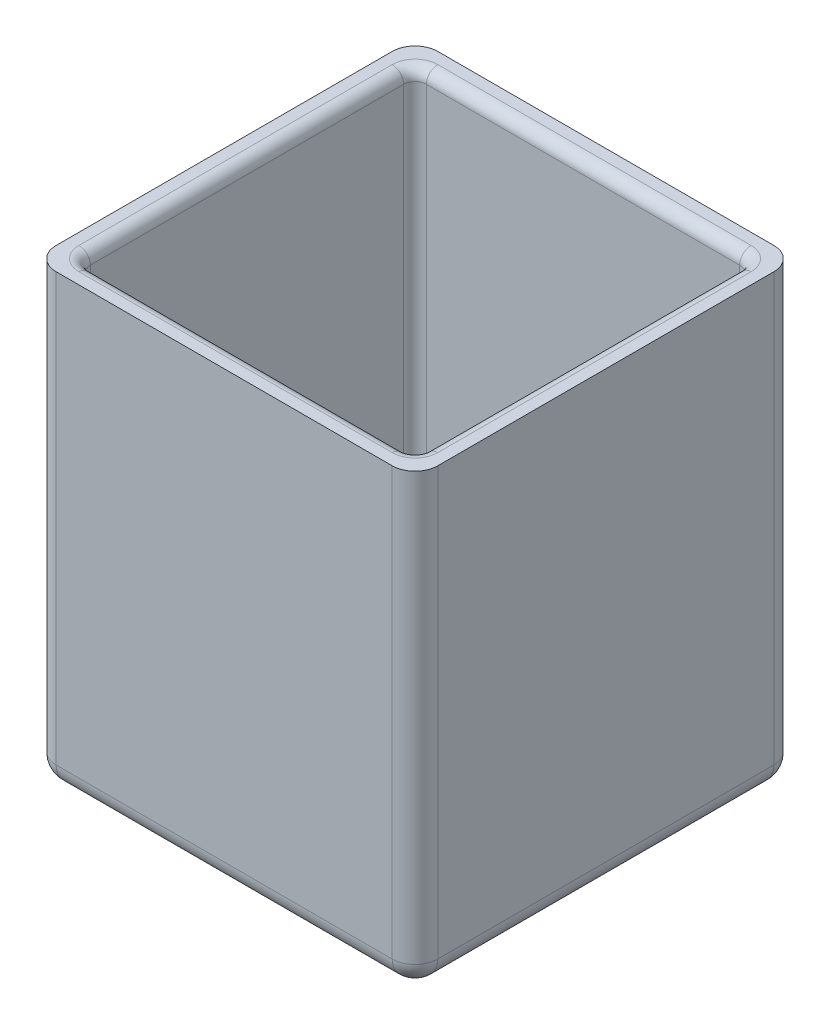
ISO-10303-21;
HEADER;
FILE_DESCRIPTION(('STEP AP214'),'2;1');
FILE_NAME('part.step','',(''),(''),'','','');
FILE_SCHEMA(('AUTOMOTIVE_DESIGN { 1 0 10303 214 1 1 1 1 }'));
ENDSEC;
DATA;
#1=APPLICATION_CONTEXT('core data for automotive mechanical design processes');
#2=APPLICATION_PROTOCOL_DEFINITION('international standard','automotive_design',2000,#1);
#3=PRODUCT_CONTEXT('',#1,'mechanical');
#4=PRODUCT('Part','Part','',(#3));
#5=PRODUCT_RELATED_PRODUCT_CATEGORY('part','',(#4));
#6=PRODUCT_DEFINITION_FORMATION('','',#4);
#7=PRODUCT_DEFINITION_CONTEXT('part definition',#1,'design');
#8=PRODUCT_DEFINITION('design','',#6,#7);
#9=PRODUCT_DEFINITION_SHAPE('','',#8);
#10=(LENGTH_UNIT() NAMED_UNIT(*) SI_UNIT(.MILLI.,.METRE.));
#11=(NAMED_UNIT(*) PLANE_ANGLE_UNIT() SI_UNIT($,.RADIAN.));
#12=(NAMED_UNIT(*) SI_UNIT($,.STERADIAN.) SOLID_ANGLE_UNIT());
#13=UNCERTAINTY_MEASURE_WITH_UNIT(LENGTH_MEASURE(1.E-05),#10,'distance_accuracy_value','');
#14=(GEOMETRIC_REPRESENTATION_CONTEXT(3) GLOBAL_UNCERTAINTY_ASSIGNED_CONTEXT((#13)) GLOBAL_UNIT_ASSIGNED_CONTEXT((#10,
#11,#12)) REPRESENTATION_CONTEXT('',''));
#15=CARTESIAN_POINT('',(0.,0.,0.));
#16=DIRECTION('',(0.,0.,1.));
#17=DIRECTION('',(1.,0.,0.));
#18=AXIS2_PLACEMENT_3D('',#15,#16,#17);
#19=CARTESIAN_POINT('',(0.,39.5,0.));
#20=DIRECTION('',(0.,-1.,0.));
#21=DIRECTION('',(0.,0.,-1.));
#22=AXIS2_PLACEMENT_3D('',#19,#20,#21);
#23=PLANE('',#22);
#24=DIRECTION('',(-1.,0.,0.));
#25=VECTOR('',#24,1.);
#26=CARTESIAN_POINT('',(0.,39.5,-33.5));
#27=LINE('',#26,#25);
#28=CARTESIAN_POINT('',(31.5,39.5,-33.5));
#29=VERTEX_POINT('',#28);
#30=CARTESIAN_POINT('',(2.,39.5,-33.5));
#31=VERTEX_POINT('',#30);
#32=EDGE_CURVE('E207',#29,#31,#27,.T.);
#33=ORIENTED_EDGE('',*,*,#32,.T.);
#34=CARTESIAN_POINT('',(2.,39.5,-31.5));
#35=DIRECTION('',(0.,-1.,0.));
#36=DIRECTION('',(0.,0.,-1.));
#37=AXIS2_PLACEMENT_3D('',#34,#35,#36);
#38=CIRCLE('',#37,2.);
#39=CARTESIAN_POINT('',(0.,39.5,-31.5));
#40=VERTEX_POINT('',#39);
#41=EDGE_CURVE('E201',#31,#40,#38,.F.);
#42=ORIENTED_EDGE('',*,*,#41,.T.);
#43=DIRECTION('',(0.,0.,1.));
#44=VECTOR('',#43,1.);
#45=CARTESIAN_POINT('',(0.,39.5,0.));
#46=LINE('',#45,#44);
#47=CARTESIAN_POINT('',(0.,39.5,-2.));
#48=VERTEX_POINT('',#47);
#49=EDGE_CURVE('E204',#40,#48,#46,.T.);
#50=ORIENTED_EDGE('',*,*,#49,.T.);
#51=CARTESIAN_POINT('',(2.,39.5,-2.));
#52=DIRECTION('',(0.,-1.,0.));
#53=DIRECTION('',(0.,0.,-1.));
#54=AXIS2_PLACEMENT_3D('',#51,#52,#53);
#55=CIRCLE('',#54,2.);
#56=CARTESIAN_POINT('',(2.,39.5,0.));
#57=VERTEX_POINT('',#56);
#58=EDGE_CURVE('E212',#48,#57,#55,.F.);
#59=ORIENTED_EDGE('',*,*,#58,.T.);
#60=DIRECTION('',(1.,0.,0.));
#61=VECTOR('',#60,1.);
#62=CARTESIAN_POINT('',(0.,39.5,0.));
#63=LINE('',#62,#61);
#64=CARTESIAN_POINT('',(31.5,39.5,0.));
#65=VERTEX_POINT('',#64);
#66=EDGE_CURVE('E221',#57,#65,#63,.T.);
#67=ORIENTED_EDGE('',*,*,#66,.T.);
#68=CARTESIAN_POINT('',(31.5,39.5,-2.));
#69=DIRECTION('',(0.,-1.,0.));
#70=DIRECTION('',(0.,0.,-1.));
#71=AXIS2_PLACEMENT_3D('',#68,#69,#70);
#72=CIRCLE('',#71,2.);
#73=CARTESIAN_POINT('',(33.5,39.5,-2.));
#74=VERTEX_POINT('',#73);
#75=EDGE_CURVE('E236',#65,#74,#72,.F.);
#76=ORIENTED_EDGE('',*,*,#75,.T.);
#77=DIRECTION('',(0.,0.,-1.));
#78=VECTOR('',#77,1.);
#79=CARTESIAN_POINT('',(33.5,39.5,0.));
#80=LINE('',#79,#78);
#81=CARTESIAN_POINT('',(33.5,39.5,-31.5));
#82=VERTEX_POINT('',#81);
#83=EDGE_CURVE('E912',#74,#82,#80,.T.);
#84=ORIENTED_EDGE('',*,*,#83,.T.);
#85=CARTESIAN_POINT('',(31.5,39.5,-31.5));
#86=DIRECTION('',(0.,-1.,0.));
#87=DIRECTION('',(0.,0.,-1.));
#88=AXIS2_PLACEMENT_3D('',#85,#86,#87);
#89=CIRCLE('',#88,2.);
#90=EDGE_CURVE('E238',#82,#29,#89,.F.);
#91=ORIENTED_EDGE('',*,*,#90,.T.);
#92=EDGE_LOOP('',(#33,#42,#50,#59,#67,#76,#84,#91));
#93=FACE_BOUND('',#92,.T.);
#94=CARTESIAN_POINT('',(30.5,39.5,-3.00000000000002));
#95=DIRECTION('',(0.,-1.,0.));
#96=DIRECTION('',(0.,0.,-1.));
#97=AXIS2_PLACEMENT_3D('',#94,#95,#96);
#98=CIRCLE('',#97,2.);
#99=CARTESIAN_POINT('',(30.5,39.5,-1.00000000000002));
#100=VERTEX_POINT('',#99);
#101=CARTESIAN_POINT('',(32.5,39.5,-3.00000000000002));
#102=VERTEX_POINT('',#101);
#103=EDGE_CURVE('E323',#100,#102,#98,.F.);
#104=ORIENTED_EDGE('',*,*,#103,.F.);
#105=DIRECTION('',(1.,0.,0.));
#106=VECTOR('',#105,1.);
#107=CARTESIAN_POINT('',(2.,39.5,-1.));
#108=LINE('',#107,#106);
#109=CARTESIAN_POINT('',(3.,39.5,-1.));
#110=VERTEX_POINT('',#109);
#111=EDGE_CURVE('E320',#100,#110,#108,.F.);
#112=ORIENTED_EDGE('',*,*,#111,.T.);
#113=CARTESIAN_POINT('',(3.,39.5,-3.));
#114=DIRECTION('',(0.,-1.,0.));
#115=DIRECTION('',(0.,0.,-1.));
#116=AXIS2_PLACEMENT_3D('',#113,#114,#115);
#117=CIRCLE('',#116,2.);
#118=CARTESIAN_POINT('',(1.,39.5,-3.));
#119=VERTEX_POINT('',#118);
#120=EDGE_CURVE('E317',#119,#110,#117,.F.);
#121=ORIENTED_EDGE('',*,*,#120,.F.);
#122=DIRECTION('',(0.,0.,1.));
#123=VECTOR('',#122,1.);
#124=CARTESIAN_POINT('',(1.,39.5,-31.5));
#125=LINE('',#124,#123);
#126=CARTESIAN_POINT('',(1.,39.5,-30.5));
#127=VERTEX_POINT('',#126);
#128=EDGE_CURVE('E313',#119,#127,#125,.F.);
#129=ORIENTED_EDGE('',*,*,#128,.T.);
#130=CARTESIAN_POINT('',(3.,39.5,-30.5));
#131=DIRECTION('',(0.,-1.,0.));
#132=DIRECTION('',(0.,0.,-1.));
#133=AXIS2_PLACEMENT_3D('',#130,#131,#132);
#134=CIRCLE('',#133,2.);
#135=CARTESIAN_POINT('',(3.,39.5,-32.5));
#136=VERTEX_POINT('',#135);
#137=EDGE_CURVE('E310',#136,#127,#134,.F.);
#138=ORIENTED_EDGE('',*,*,#137,.F.);
#139=DIRECTION('',(-1.,0.,0.));
#140=VECTOR('',#139,1.);
#141=CARTESIAN_POINT('',(31.5,39.5,-32.5));
#142=LINE('',#141,#140);
#143=CARTESIAN_POINT('',(30.5,39.5,-32.5));
#144=VERTEX_POINT('',#143);
#145=EDGE_CURVE('E308',#136,#144,#142,.F.);
#146=ORIENTED_EDGE('',*,*,#145,.T.);
#147=CARTESIAN_POINT('',(30.5,39.5,-30.5));
#148=DIRECTION('',(0.,-1.,0.));
#149=DIRECTION('',(0.,0.,-1.));
#150=AXIS2_PLACEMENT_3D('',#147,#148,#149);
#151=CIRCLE('',#150,2.);
#152=CARTESIAN_POINT('',(32.5,39.5,-30.5));
#153=VERTEX_POINT('',#152);
#154=EDGE_CURVE('E305',#153,#144,#151,.F.);
#155=ORIENTED_EDGE('',*,*,#154,.F.);
#156=DIRECTION('',(0.,0.,-1.));
#157=VECTOR('',#156,1.);
#158=CARTESIAN_POINT('',(32.5,39.5,-2.00000000000002));
#159=LINE('',#158,#157);
#160=EDGE_CURVE('E315',#153,#102,#159,.F.);
#161=ORIENTED_EDGE('',*,*,#160,.T.);
#162=EDGE_LOOP('',(#104,#112,#121,#129,#138,#146,#155,#161));
#163=FACE_BOUND('',#162,.T.);
#164=ADVANCED_FACE('F39',(#93,#163),#23,.F.);
#165=CARTESIAN_POINT('',(2.,39.5,-31.5));
#166=DIRECTION('',(1.,0.,0.));
#167=DIRECTION('',(0.,0.,-1.));
#168=AXIS2_PLACEMENT_3D('',#165,#166,#167);
#169=PLANE('',#168);
#170=DIRECTION('',(0.,0.,-1.));
#171=VECTOR('',#170,1.);
#172=CARTESIAN_POINT('',(2.,4.,-31.5));
#173=LINE('',#172,#171);
#174=CARTESIAN_POINT('',(2.,4.,-3.));
#175=VERTEX_POINT('',#174);
#176=CARTESIAN_POINT('',(2.,4.,-30.5));
#177=VERTEX_POINT('',#176);
#178=EDGE_CURVE('E337',#175,#177,#173,.T.);
#179=ORIENTED_EDGE('',*,*,#178,.T.);
#180=DIRECTION('',(0.,-1.,0.));
#181=VECTOR('',#180,1.);
#182=CARTESIAN_POINT('',(2.,39.5,-30.5));
#183=LINE('',#182,#181);
#184=CARTESIAN_POINT('',(2.,38.5,-30.5));
#185=VERTEX_POINT('',#184);
#186=EDGE_CURVE('E342',#177,#185,#183,.F.);
#187=ORIENTED_EDGE('',*,*,#186,.T.);
#188=DIRECTION('',(0.,0.,1.));
#189=VECTOR('',#188,1.);
#190=CARTESIAN_POINT('',(2.,38.5,-2.));
#191=LINE('',#190,#189);
#192=CARTESIAN_POINT('',(2.,38.5,-3.));
#193=VERTEX_POINT('',#192);
#194=EDGE_CURVE('E339',#185,#193,#191,.T.);
#195=ORIENTED_EDGE('',*,*,#194,.T.);
#196=DIRECTION('',(0.,-1.,0.));
#197=VECTOR('',#196,1.);
#198=CARTESIAN_POINT('',(2.,3.,-3.));
#199=LINE('',#198,#197);
#200=EDGE_CURVE('E335',#193,#175,#199,.T.);
#201=ORIENTED_EDGE('',*,*,#200,.T.);
#202=EDGE_LOOP('',(#179,#187,#195,#201));
#203=FACE_BOUND('',#202,.T.);
#204=ADVANCED_FACE('F437',(#203),#169,.T.);
#205=CARTESIAN_POINT('',(2.,39.5,-2.));
#206=DIRECTION('',(0.,0.,-1.));
#207=DIRECTION('',(-1.,0.,0.));
#208=AXIS2_PLACEMENT_3D('',#205,#206,#207);
#209=PLANE('',#208);
#210=DIRECTION('',(1.,0.,0.));
#211=VECTOR('',#210,1.);
#212=CARTESIAN_POINT('',(31.5,38.5,-2.00000000000002));
#213=LINE('',#212,#211);
#214=CARTESIAN_POINT('',(3.,38.5,-2.));
#215=VERTEX_POINT('',#214);
#216=CARTESIAN_POINT('',(30.5,38.5,-2.00000000000002));
#217=VERTEX_POINT('',#216);
#218=EDGE_CURVE('E300',#215,#217,#213,.T.);
#219=ORIENTED_EDGE('',*,*,#218,.T.);
#220=DIRECTION('',(0.,-1.,0.));
#221=VECTOR('',#220,1.);
#222=CARTESIAN_POINT('',(30.5,3.,-2.00000000000002));
#223=LINE('',#222,#221);
#224=CARTESIAN_POINT('',(30.5,4.,-2.00000000000002));
#225=VERTEX_POINT('',#224);
#226=EDGE_CURVE('E303',#217,#225,#223,.T.);
#227=ORIENTED_EDGE('',*,*,#226,.T.);
#228=DIRECTION('',(-1.,0.,0.));
#229=VECTOR('',#228,1.);
#230=CARTESIAN_POINT('',(2.,4.,-2.));
#231=LINE('',#230,#229);
#232=CARTESIAN_POINT('',(3.,4.,-2.));
#233=VERTEX_POINT('',#232);
#234=EDGE_CURVE('E298',#225,#233,#231,.T.);
#235=ORIENTED_EDGE('',*,*,#234,.T.);
#236=DIRECTION('',(0.,-1.,0.));
#237=VECTOR('',#236,1.);
#238=CARTESIAN_POINT('',(3.,39.5,-2.));
#239=LINE('',#238,#237);
#240=EDGE_CURVE('E275',#233,#215,#239,.F.);
#241=ORIENTED_EDGE('',*,*,#240,.T.);
#242=EDGE_LOOP('',(#219,#227,#235,#241));
#243=FACE_BOUND('',#242,.T.);
#244=ADVANCED_FACE('F490',(#243),#209,.T.);
#245=CARTESIAN_POINT('',(31.5,39.5,-31.5));
#246=DIRECTION('',(-1.,0.,0.));
#247=DIRECTION('',(0.,0.,1.));
#248=AXIS2_PLACEMENT_3D('',#245,#246,#247);
#249=PLANE('',#248);
#250=DIRECTION('',(0.,0.,-1.));
#251=VECTOR('',#250,1.);
#252=CARTESIAN_POINT('',(31.5,38.5,-31.5));
#253=LINE('',#252,#251);
#254=CARTESIAN_POINT('',(31.5,38.5,-3.00000000000002));
#255=VERTEX_POINT('',#254);
#256=CARTESIAN_POINT('',(31.5,38.5,-30.5));
#257=VERTEX_POINT('',#256);
#258=EDGE_CURVE('E330',#255,#257,#253,.T.);
#259=ORIENTED_EDGE('',*,*,#258,.T.);
#260=DIRECTION('',(0.,-1.,0.));
#261=VECTOR('',#260,1.);
#262=CARTESIAN_POINT('',(31.5,3.,-30.5));
#263=LINE('',#262,#261);
#264=CARTESIAN_POINT('',(31.5,4.,-30.5));
#265=VERTEX_POINT('',#264);
#266=EDGE_CURVE('E333',#257,#265,#263,.T.);
#267=ORIENTED_EDGE('',*,*,#266,.T.);
#268=DIRECTION('',(0.,0.,1.));
#269=VECTOR('',#268,1.);
#270=CARTESIAN_POINT('',(31.5,4.,-31.5));
#271=LINE('',#270,#269);
#272=CARTESIAN_POINT('',(31.5,4.,-3.00000000000002));
#273=VERTEX_POINT('',#272);
#274=EDGE_CURVE('E328',#265,#273,#271,.T.);
#275=ORIENTED_EDGE('',*,*,#274,.T.);
#276=DIRECTION('',(0.,-1.,0.));
#277=VECTOR('',#276,1.);
#278=CARTESIAN_POINT('',(31.5,39.5,-3.00000000000002));
#279=LINE('',#278,#277);
#280=EDGE_CURVE('E326',#273,#255,#279,.F.);
#281=ORIENTED_EDGE('',*,*,#280,.T.);
#282=EDGE_LOOP('',(#259,#267,#275,#281));
#283=FACE_BOUND('',#282,.T.);
#284=ADVANCED_FACE('F832',(#283),#249,.T.);
#285=CARTESIAN_POINT('',(2.,39.5,-31.5));
#286=DIRECTION('',(0.,0.,1.));
#287=DIRECTION('',(1.,0.,0.));
#288=AXIS2_PLACEMENT_3D('',#285,#286,#287);
#289=PLANE('',#288);
#290=DIRECTION('',(0.,-1.,0.));
#291=VECTOR('',#290,1.);
#292=CARTESIAN_POINT('',(30.5,39.5,-31.5));
#293=LINE('',#292,#291);
#294=CARTESIAN_POINT('',(30.5,4.,-31.5));
#295=VERTEX_POINT('',#294);
#296=CARTESIAN_POINT('',(30.5,38.5,-31.5));
#297=VERTEX_POINT('',#296);
#298=EDGE_CURVE('E48',#295,#297,#293,.F.);
#299=ORIENTED_EDGE('',*,*,#298,.T.);
#300=DIRECTION('',(-1.,0.,0.));
#301=VECTOR('',#300,1.);
#302=CARTESIAN_POINT('',(2.,38.5,-31.5));
#303=LINE('',#302,#301);
#304=CARTESIAN_POINT('',(3.,38.5,-31.5));
#305=VERTEX_POINT('',#304);
#306=EDGE_CURVE('E11',#297,#305,#303,.T.);
#307=ORIENTED_EDGE('',*,*,#306,.T.);
#308=DIRECTION('',(0.,-1.,0.));
#309=VECTOR('',#308,1.);
#310=CARTESIAN_POINT('',(3.,3.,-31.5));
#311=LINE('',#310,#309);
#312=CARTESIAN_POINT('',(3.,4.,-31.5));
#313=VERTEX_POINT('',#312);
#314=EDGE_CURVE('E353',#305,#313,#311,.T.);
#315=ORIENTED_EDGE('',*,*,#314,.T.);
#316=DIRECTION('',(1.,0.,0.));
#317=VECTOR('',#316,1.);
#318=CARTESIAN_POINT('',(2.,4.,-31.5));
#319=LINE('',#318,#317);
#320=EDGE_CURVE('E59',#313,#295,#319,.T.);
#321=ORIENTED_EDGE('',*,*,#320,.T.);
#322=EDGE_LOOP('',(#299,#307,#315,#321));
#323=FACE_BOUND('',#322,.T.);
#324=ADVANCED_FACE('F475',(#323),#289,.T.);
#325=CARTESIAN_POINT('',(0.,0.,0.));
#326=DIRECTION('',(0.,-1.,0.));
#327=DIRECTION('',(0.,0.,-1.));
#328=AXIS2_PLACEMENT_3D('',#325,#326,#327);
#329=PLANE('',#328);
#330=DIRECTION('',(0.,0.,-1.));
#331=VECTOR('',#330,1.);
#332=CARTESIAN_POINT('',(31.5,0.,-2.));
#333=LINE('',#332,#331);
#334=CARTESIAN_POINT('',(31.5,0.,-31.5));
#335=VERTEX_POINT('',#334);
#336=CARTESIAN_POINT('',(31.5,0.,-2.));
#337=VERTEX_POINT('',#336);
#338=EDGE_CURVE('E255',#335,#337,#333,.F.);
#339=ORIENTED_EDGE('',*,*,#338,.T.);
#340=DIRECTION('',(1.,0.,0.));
#341=VECTOR('',#340,1.);
#342=CARTESIAN_POINT('',(2.,0.,-2.));
#343=LINE('',#342,#341);
#344=CARTESIAN_POINT('',(2.,0.,-2.));
#345=VERTEX_POINT('',#344);
#346=EDGE_CURVE('E261',#337,#345,#343,.F.);
#347=ORIENTED_EDGE('',*,*,#346,.T.);
#348=DIRECTION('',(0.,0.,1.));
#349=VECTOR('',#348,1.);
#350=CARTESIAN_POINT('',(2.,0.,-31.5));
#351=LINE('',#350,#349);
#352=CARTESIAN_POINT('',(2.,0.,-31.5));
#353=VERTEX_POINT('',#352);
#354=EDGE_CURVE('E259',#345,#353,#351,.F.);
#355=ORIENTED_EDGE('',*,*,#354,.T.);
#356=DIRECTION('',(-1.,0.,0.));
#357=VECTOR('',#356,1.);
#358=CARTESIAN_POINT('',(31.5,0.,-31.5));
#359=LINE('',#358,#357);
#360=EDGE_CURVE('E257',#353,#335,#359,.F.);
#361=ORIENTED_EDGE('',*,*,#360,.T.);
#362=EDGE_LOOP('',(#339,#347,#355,#361));
#363=FACE_BOUND('',#362,.T.);
#364=ADVANCED_FACE('F494',(#363),#329,.T.);
#365=CARTESIAN_POINT('',(0.,39.5,0.));
#366=DIRECTION('',(1.,0.,0.));
#367=DIRECTION('',(0.,0.,-1.));
#368=AXIS2_PLACEMENT_3D('',#365,#366,#367);
#369=PLANE('',#368);
#370=DIRECTION('',(0.,-1.,0.));
#371=VECTOR('',#370,1.);
#372=CARTESIAN_POINT('',(0.,39.5,-31.5));
#373=LINE('',#372,#371);
#374=CARTESIAN_POINT('',(0.,2.,-31.5));
#375=VERTEX_POINT('',#374);
#376=EDGE_CURVE('E217',#40,#375,#373,.T.);
#377=ORIENTED_EDGE('',*,*,#376,.T.);
#378=DIRECTION('',(0.,0.,1.));
#379=VECTOR('',#378,1.);
#380=CARTESIAN_POINT('',(0.,2.,-2.));
#381=LINE('',#380,#379);
#382=CARTESIAN_POINT('',(0.,2.,-2.));
#383=VERTEX_POINT('',#382);
#384=EDGE_CURVE('E266',#375,#383,#381,.T.);
#385=ORIENTED_EDGE('',*,*,#384,.T.);
#386=DIRECTION('',(0.,-1.,0.));
#387=VECTOR('',#386,1.);
#388=CARTESIAN_POINT('',(0.,39.5,-2.));
#389=LINE('',#388,#387);
#390=EDGE_CURVE('E220',#383,#48,#389,.F.);
#391=ORIENTED_EDGE('',*,*,#390,.T.);
#392=ORIENTED_EDGE('',*,*,#49,.F.);
#393=EDGE_LOOP('',(#377,#385,#391,#392));
#394=FACE_BOUND('',#393,.T.);
#395=ADVANCED_FACE('F216',(#394),#369,.F.);
#396=CARTESIAN_POINT('',(0.,39.5,0.));
#397=DIRECTION('',(0.,0.,-1.));
#398=DIRECTION('',(-1.,0.,0.));
#399=AXIS2_PLACEMENT_3D('',#396,#397,#398);
#400=PLANE('',#399);
#401=DIRECTION('',(0.,-1.,0.));
#402=VECTOR('',#401,1.);
#403=CARTESIAN_POINT('',(2.,39.5,0.));
#404=LINE('',#403,#402);
#405=CARTESIAN_POINT('',(2.,2.,0.));
#406=VERTEX_POINT('',#405);
#407=EDGE_CURVE('E242',#57,#406,#404,.T.);
#408=ORIENTED_EDGE('',*,*,#407,.T.);
#409=DIRECTION('',(1.,0.,0.));
#410=VECTOR('',#409,1.);
#411=CARTESIAN_POINT('',(31.5,2.,0.));
#412=LINE('',#411,#410);
#413=CARTESIAN_POINT('',(31.5,2.,0.));
#414=VERTEX_POINT('',#413);
#415=EDGE_CURVE('E253',#406,#414,#412,.T.);
#416=ORIENTED_EDGE('',*,*,#415,.T.);
#417=DIRECTION('',(0.,-1.,0.));
#418=VECTOR('',#417,1.);
#419=CARTESIAN_POINT('',(31.5,39.5,0.));
#420=LINE('',#419,#418);
#421=EDGE_CURVE('E211',#414,#65,#420,.F.);
#422=ORIENTED_EDGE('',*,*,#421,.T.);
#423=ORIENTED_EDGE('',*,*,#66,.F.);
#424=EDGE_LOOP('',(#408,#416,#422,#423));
#425=FACE_BOUND('',#424,.T.);
#426=ADVANCED_FACE('F505',(#425),#400,.F.);
#427=CARTESIAN_POINT('',(33.5,39.5,0.));
#428=DIRECTION('',(-1.,0.,0.));
#429=DIRECTION('',(0.,0.,1.));
#430=AXIS2_PLACEMENT_3D('',#427,#428,#429);
#431=PLANE('',#430);
#432=DIRECTION('',(0.,-1.,0.));
#433=VECTOR('',#432,1.);
#434=CARTESIAN_POINT('',(33.5,39.5,-2.));
#435=LINE('',#434,#433);
#436=CARTESIAN_POINT('',(33.5,2.,-2.));
#437=VERTEX_POINT('',#436);
#438=EDGE_CURVE('E245',#74,#437,#435,.T.);
#439=ORIENTED_EDGE('',*,*,#438,.T.);
#440=DIRECTION('',(0.,0.,-1.));
#441=VECTOR('',#440,1.);
#442=CARTESIAN_POINT('',(33.5,2.,-31.5));
#443=LINE('',#442,#441);
#444=CARTESIAN_POINT('',(33.5,2.,-31.5));
#445=VERTEX_POINT('',#444);
#446=EDGE_CURVE('E273',#437,#445,#443,.T.);
#447=ORIENTED_EDGE('',*,*,#446,.T.);
#448=DIRECTION('',(0.,-1.,0.));
#449=VECTOR('',#448,1.);
#450=CARTESIAN_POINT('',(33.5,39.5,-31.5));
#451=LINE('',#450,#449);
#452=EDGE_CURVE('E248',#445,#82,#451,.F.);
#453=ORIENTED_EDGE('',*,*,#452,.T.);
#454=ORIENTED_EDGE('',*,*,#83,.F.);
#455=EDGE_LOOP('',(#439,#447,#453,#454));
#456=FACE_BOUND('',#455,.T.);
#457=ADVANCED_FACE('F501',(#456),#431,.F.);
#458=CARTESIAN_POINT('',(0.,39.5,-33.5));
#459=DIRECTION('',(0.,0.,1.));
#460=DIRECTION('',(1.,0.,0.));
#461=AXIS2_PLACEMENT_3D('',#458,#459,#460);
#462=PLANE('',#461);
#463=DIRECTION('',(0.,-1.,0.));
#464=VECTOR('',#463,1.);
#465=CARTESIAN_POINT('',(31.5,39.5,-33.5));
#466=LINE('',#465,#464);
#467=CARTESIAN_POINT('',(31.5,2.,-33.5));
#468=VERTEX_POINT('',#467);
#469=EDGE_CURVE('E227',#29,#468,#466,.T.);
#470=ORIENTED_EDGE('',*,*,#469,.T.);
#471=DIRECTION('',(-1.,0.,0.));
#472=VECTOR('',#471,1.);
#473=CARTESIAN_POINT('',(2.,2.,-33.5));
#474=LINE('',#473,#472);
#475=CARTESIAN_POINT('',(2.,2.,-33.5));
#476=VERTEX_POINT('',#475);
#477=EDGE_CURVE('E269',#468,#476,#474,.T.);
#478=ORIENTED_EDGE('',*,*,#477,.T.);
#479=DIRECTION('',(0.,-1.,0.));
#480=VECTOR('',#479,1.);
#481=CARTESIAN_POINT('',(2.,39.5,-33.5));
#482=LINE('',#481,#480);
#483=EDGE_CURVE('E230',#476,#31,#482,.F.);
#484=ORIENTED_EDGE('',*,*,#483,.T.);
#485=ORIENTED_EDGE('',*,*,#32,.F.);
#486=EDGE_LOOP('',(#470,#478,#484,#485));
#487=FACE_BOUND('',#486,.T.);
#488=ADVANCED_FACE('F498',(#487),#462,.F.);
#489=CARTESIAN_POINT('',(0.,3.,0.));
#490=DIRECTION('',(0.,-1.,0.));
#491=DIRECTION('',(0.,0.,-1.));
#492=AXIS2_PLACEMENT_3D('',#489,#490,#491);
#493=PLANE('',#492);
#494=DIRECTION('',(-1.,0.,0.));
#495=VECTOR('',#494,1.);
#496=CARTESIAN_POINT('',(0.,3.,-3.));
#497=LINE('',#496,#495);
#498=CARTESIAN_POINT('',(3.,3.,-3.));
#499=VERTEX_POINT('',#498);
#500=CARTESIAN_POINT('',(30.5,3.,-3.00000000000002));
#501=VERTEX_POINT('',#500);
#502=EDGE_CURVE('E348',#499,#501,#497,.F.);
#503=ORIENTED_EDGE('',*,*,#502,.T.);
#504=DIRECTION('',(0.,0.,1.));
#505=VECTOR('',#504,1.);
#506=CARTESIAN_POINT('',(30.5,3.,0.));
#507=LINE('',#506,#505);
#508=CARTESIAN_POINT('',(30.5,3.,-30.5));
#509=VERTEX_POINT('',#508);
#510=EDGE_CURVE('E350',#501,#509,#507,.F.);
#511=ORIENTED_EDGE('',*,*,#510,.T.);
#512=DIRECTION('',(1.,0.,0.));
#513=VECTOR('',#512,1.);
#514=CARTESIAN_POINT('',(0.,3.,-30.5));
#515=LINE('',#514,#513);
#516=CARTESIAN_POINT('',(3.,3.,-30.5));
#517=VERTEX_POINT('',#516);
#518=EDGE_CURVE('E344',#509,#517,#515,.F.);
#519=ORIENTED_EDGE('',*,*,#518,.T.);
#520=DIRECTION('',(0.,0.,-1.));
#521=VECTOR('',#520,1.);
#522=CARTESIAN_POINT('',(3.,3.,0.));
#523=LINE('',#522,#521);
#524=EDGE_CURVE('E346',#517,#499,#523,.F.);
#525=ORIENTED_EDGE('',*,*,#524,.T.);
#526=EDGE_LOOP('',(#503,#511,#519,#525));
#527=FACE_BOUND('',#526,.T.);
#528=ADVANCED_FACE('F446',(#527),#493,.F.);
#529=CARTESIAN_POINT('',(2.,39.5,-31.5));
#530=DIRECTION('',(0.,-1.,0.));
#531=DIRECTION('',(0.,0.,-1.));
#532=AXIS2_PLACEMENT_3D('',#529,#530,#531);
#533=CYLINDRICAL_SURFACE('',#532,2.);
#534=ORIENTED_EDGE('',*,*,#483,.F.);
#535=CARTESIAN_POINT('',(2.,2.,-31.5));
#536=DIRECTION('',(0.,-1.,0.));
#537=DIRECTION('',(0.,0.,-1.));
#538=AXIS2_PLACEMENT_3D('',#535,#536,#537);
#539=CIRCLE('',#538,2.);
#540=EDGE_CURVE('E226',#476,#375,#539,.F.);
#541=ORIENTED_EDGE('',*,*,#540,.T.);
#542=ORIENTED_EDGE('',*,*,#376,.F.);
#543=ORIENTED_EDGE('',*,*,#41,.F.);
#544=EDGE_LOOP('',(#534,#541,#542,#543));
#545=FACE_BOUND('',#544,.T.);
#546=ADVANCED_FACE('F224',(#545),#533,.T.);
#547=CARTESIAN_POINT('',(2.,39.5,-2.));
#548=DIRECTION('',(0.,-1.,0.));
#549=DIRECTION('',(0.,0.,-1.));
#550=AXIS2_PLACEMENT_3D('',#547,#548,#549);
#551=CYLINDRICAL_SURFACE('',#550,2.);
#552=ORIENTED_EDGE('',*,*,#390,.F.);
#553=CARTESIAN_POINT('',(2.,2.,-2.));
#554=DIRECTION('',(0.,-1.,0.));
#555=DIRECTION('',(0.,0.,-1.));
#556=AXIS2_PLACEMENT_3D('',#553,#554,#555);
#557=CIRCLE('',#556,2.);
#558=EDGE_CURVE('E264',#383,#406,#557,.F.);
#559=ORIENTED_EDGE('',*,*,#558,.T.);
#560=ORIENTED_EDGE('',*,*,#407,.F.);
#561=ORIENTED_EDGE('',*,*,#58,.F.);
#562=EDGE_LOOP('',(#552,#559,#560,#561));
#563=FACE_BOUND('',#562,.T.);
#564=ADVANCED_FACE('F514',(#563),#551,.T.);
#565=CARTESIAN_POINT('',(31.5,39.5,-31.5));
#566=DIRECTION('',(0.,-1.,0.));
#567=DIRECTION('',(0.,0.,-1.));
#568=AXIS2_PLACEMENT_3D('',#565,#566,#567);
#569=CYLINDRICAL_SURFACE('',#568,2.);
#570=ORIENTED_EDGE('',*,*,#452,.F.);
#571=CARTESIAN_POINT('',(31.5,2.,-31.5));
#572=DIRECTION('',(0.,-1.,0.));
#573=DIRECTION('',(0.,0.,-1.));
#574=AXIS2_PLACEMENT_3D('',#571,#572,#573);
#575=CIRCLE('',#574,2.);
#576=EDGE_CURVE('E271',#445,#468,#575,.F.);
#577=ORIENTED_EDGE('',*,*,#576,.T.);
#578=ORIENTED_EDGE('',*,*,#469,.F.);
#579=ORIENTED_EDGE('',*,*,#90,.F.);
#580=EDGE_LOOP('',(#570,#577,#578,#579));
#581=FACE_BOUND('',#580,.T.);
#582=ADVANCED_FACE('F517',(#581),#569,.T.);
#583=CARTESIAN_POINT('',(31.5,39.5,-2.));
#584=DIRECTION('',(0.,-1.,0.));
#585=DIRECTION('',(0.,0.,-1.));
#586=AXIS2_PLACEMENT_3D('',#583,#584,#585);
#587=CYLINDRICAL_SURFACE('',#586,2.);
#588=ORIENTED_EDGE('',*,*,#421,.F.);
#589=CARTESIAN_POINT('',(31.5,2.,-2.));
#590=DIRECTION('',(0.,-1.,0.));
#591=DIRECTION('',(0.,0.,-1.));
#592=AXIS2_PLACEMENT_3D('',#589,#590,#591);
#593=CIRCLE('',#592,2.);
#594=EDGE_CURVE('E250',#414,#437,#593,.F.);
#595=ORIENTED_EDGE('',*,*,#594,.T.);
#596=ORIENTED_EDGE('',*,*,#438,.F.);
#597=ORIENTED_EDGE('',*,*,#75,.F.);
#598=EDGE_LOOP('',(#588,#595,#596,#597));
#599=FACE_BOUND('',#598,.T.);
#600=ADVANCED_FACE('F521',(#599),#587,.T.);
#601=CARTESIAN_POINT('',(2.,2.,-31.5));
#602=DIRECTION('',(0.,-1.,0.));
#603=DIRECTION('',(0.,0.,-1.));
#604=AXIS2_PLACEMENT_3D('',#601,#602,#603);
#605=SPHERICAL_SURFACE('',#604,2.);
#606=CARTESIAN_POINT('',(2.,2.,-31.5));
#607=DIRECTION('',(0.,0.,1.));
#608=DIRECTION('',(1.,0.,0.));
#609=AXIS2_PLACEMENT_3D('',#606,#607,#608);
#610=CIRCLE('',#609,2.);
#611=EDGE_CURVE('E292',#375,#353,#610,.T.);
#612=ORIENTED_EDGE('',*,*,#611,.F.);
#613=ORIENTED_EDGE('',*,*,#540,.F.);
#614=CARTESIAN_POINT('',(2.,2.,-31.5));
#615=DIRECTION('',(1.,0.,0.));
#616=DIRECTION('',(0.,0.,-1.));
#617=AXIS2_PLACEMENT_3D('',#614,#615,#616);
#618=CIRCLE('',#617,2.);
#619=EDGE_CURVE('E222',#353,#476,#618,.T.);
#620=ORIENTED_EDGE('',*,*,#619,.F.);
#621=EDGE_LOOP('',(#612,#613,#620));
#622=FACE_BOUND('',#621,.T.);
#623=ADVANCED_FACE('F524',(#622),#605,.T.);
#624=CARTESIAN_POINT('',(0.,2.,-31.5));
#625=DIRECTION('',(1.,0.,0.));
#626=DIRECTION('',(0.,0.,-1.));
#627=AXIS2_PLACEMENT_3D('',#624,#625,#626);
#628=CYLINDRICAL_SURFACE('',#627,2.);
#629=ORIENTED_EDGE('',*,*,#619,.T.);
#630=ORIENTED_EDGE('',*,*,#477,.F.);
#631=CARTESIAN_POINT('',(31.5,2.,-31.5));
#632=DIRECTION('',(1.,0.,0.));
#633=DIRECTION('',(0.,0.,-1.));
#634=AXIS2_PLACEMENT_3D('',#631,#632,#633);
#635=CIRCLE('',#634,2.);
#636=EDGE_CURVE('E289',#335,#468,#635,.T.);
#637=ORIENTED_EDGE('',*,*,#636,.F.);
#638=ORIENTED_EDGE('',*,*,#360,.F.);
#639=EDGE_LOOP('',(#629,#630,#637,#638));
#640=FACE_BOUND('',#639,.T.);
#641=ADVANCED_FACE('F545',(#640),#628,.T.);
#642=CARTESIAN_POINT('',(2.,2.,0.));
#643=DIRECTION('',(0.,0.,-1.));
#644=DIRECTION('',(-1.,0.,0.));
#645=AXIS2_PLACEMENT_3D('',#642,#643,#644);
#646=CYLINDRICAL_SURFACE('',#645,2.);
#647=ORIENTED_EDGE('',*,*,#611,.T.);
#648=ORIENTED_EDGE('',*,*,#354,.F.);
#649=CARTESIAN_POINT('',(2.,2.,-2.));
#650=DIRECTION('',(0.,0.,1.));
#651=DIRECTION('',(1.,0.,0.));
#652=AXIS2_PLACEMENT_3D('',#649,#650,#651);
#653=CIRCLE('',#652,2.);
#654=EDGE_CURVE('E286',#383,#345,#653,.T.);
#655=ORIENTED_EDGE('',*,*,#654,.F.);
#656=ORIENTED_EDGE('',*,*,#384,.F.);
#657=EDGE_LOOP('',(#647,#648,#655,#656));
#658=FACE_BOUND('',#657,.T.);
#659=ADVANCED_FACE('F541',(#658),#646,.T.);
#660=CARTESIAN_POINT('',(31.5,2.,-31.5));
#661=DIRECTION('',(0.,-1.,0.));
#662=DIRECTION('',(0.,0.,-1.));
#663=AXIS2_PLACEMENT_3D('',#660,#661,#662);
#664=SPHERICAL_SURFACE('',#663,2.);
#665=ORIENTED_EDGE('',*,*,#636,.T.);
#666=ORIENTED_EDGE('',*,*,#576,.F.);
#667=CARTESIAN_POINT('',(31.5,2.,-31.5));
#668=DIRECTION('',(0.,0.,1.));
#669=DIRECTION('',(1.,0.,0.));
#670=AXIS2_PLACEMENT_3D('',#667,#668,#669);
#671=CIRCLE('',#670,2.);
#672=EDGE_CURVE('E283',#335,#445,#671,.T.);
#673=ORIENTED_EDGE('',*,*,#672,.F.);
#674=EDGE_LOOP('',(#665,#666,#673));
#675=FACE_BOUND('',#674,.T.);
#676=ADVANCED_FACE('F537',(#675),#664,.T.);
#677=CARTESIAN_POINT('',(2.,2.,-2.));
#678=DIRECTION('',(0.,-1.,0.));
#679=DIRECTION('',(0.,0.,-1.));
#680=AXIS2_PLACEMENT_3D('',#677,#678,#679);
#681=SPHERICAL_SURFACE('',#680,2.);
#682=ORIENTED_EDGE('',*,*,#558,.F.);
#683=ORIENTED_EDGE('',*,*,#654,.T.);
#684=CARTESIAN_POINT('',(2.,2.,-2.));
#685=DIRECTION('',(1.,0.,0.));
#686=DIRECTION('',(0.,0.,-1.));
#687=AXIS2_PLACEMENT_3D('',#684,#685,#686);
#688=CIRCLE('',#687,2.);
#689=EDGE_CURVE('E281',#406,#345,#688,.T.);
#690=ORIENTED_EDGE('',*,*,#689,.F.);
#691=EDGE_LOOP('',(#682,#683,#690));
#692=FACE_BOUND('',#691,.T.);
#693=ADVANCED_FACE('F533',(#692),#681,.T.);
#694=CARTESIAN_POINT('',(31.5,2.,0.));
#695=DIRECTION('',(0.,0.,1.));
#696=DIRECTION('',(1.,0.,0.));
#697=AXIS2_PLACEMENT_3D('',#694,#695,#696);
#698=CYLINDRICAL_SURFACE('',#697,2.);
#699=ORIENTED_EDGE('',*,*,#672,.T.);
#700=ORIENTED_EDGE('',*,*,#446,.F.);
#701=CARTESIAN_POINT('',(31.5,2.,-2.));
#702=DIRECTION('',(0.,0.,1.));
#703=DIRECTION('',(1.,0.,0.));
#704=AXIS2_PLACEMENT_3D('',#701,#702,#703);
#705=CIRCLE('',#704,2.);
#706=EDGE_CURVE('E279',#337,#437,#705,.T.);
#707=ORIENTED_EDGE('',*,*,#706,.F.);
#708=ORIENTED_EDGE('',*,*,#338,.F.);
#709=EDGE_LOOP('',(#699,#700,#707,#708));
#710=FACE_BOUND('',#709,.T.);
#711=ADVANCED_FACE('F529',(#710),#698,.T.);
#712=CARTESIAN_POINT('',(0.,2.,-2.));
#713=DIRECTION('',(-1.,0.,0.));
#714=DIRECTION('',(0.,0.,1.));
#715=AXIS2_PLACEMENT_3D('',#712,#713,#714);
#716=CYLINDRICAL_SURFACE('',#715,2.);
#717=ORIENTED_EDGE('',*,*,#689,.T.);
#718=ORIENTED_EDGE('',*,*,#346,.F.);
#719=CARTESIAN_POINT('',(31.5,2.,-2.));
#720=DIRECTION('',(1.,0.,0.));
#721=DIRECTION('',(0.,0.,-1.));
#722=AXIS2_PLACEMENT_3D('',#719,#720,#721);
#723=CIRCLE('',#722,2.);
#724=EDGE_CURVE('E276',#414,#337,#723,.T.);
#725=ORIENTED_EDGE('',*,*,#724,.F.);
#726=ORIENTED_EDGE('',*,*,#415,.F.);
#727=EDGE_LOOP('',(#717,#718,#725,#726));
#728=FACE_BOUND('',#727,.T.);
#729=ADVANCED_FACE('F482',(#728),#716,.T.);
#730=CARTESIAN_POINT('',(31.5,2.,-2.));
#731=DIRECTION('',(0.,-1.,0.));
#732=DIRECTION('',(0.,0.,-1.));
#733=AXIS2_PLACEMENT_3D('',#730,#731,#732);
#734=SPHERICAL_SURFACE('',#733,2.);
#735=ORIENTED_EDGE('',*,*,#706,.T.);
#736=ORIENTED_EDGE('',*,*,#594,.F.);
#737=ORIENTED_EDGE('',*,*,#724,.T.);
#738=EDGE_LOOP('',(#735,#736,#737));
#739=FACE_BOUND('',#738,.T.);
#740=ADVANCED_FACE('F477',(#739),#734,.T.);
#741=CARTESIAN_POINT('',(2.,4.,-30.5));
#742=DIRECTION('',(1.,0.,0.));
#743=DIRECTION('',(0.,0.,-1.));
#744=AXIS2_PLACEMENT_3D('',#741,#742,#743);
#745=CYLINDRICAL_SURFACE('',#744,1.);
#746=CARTESIAN_POINT('',(3.,4.,-30.5));
#747=DIRECTION('',(1.,0.,0.));
#748=DIRECTION('',(0.,0.,-1.));
#749=AXIS2_PLACEMENT_3D('',#746,#747,#748);
#750=CIRCLE('',#749,1.);
#751=EDGE_CURVE('E43',#517,#313,#750,.T.);
#752=ORIENTED_EDGE('',*,*,#751,.F.);
#753=ORIENTED_EDGE('',*,*,#518,.F.);
#754=CARTESIAN_POINT('',(30.5,4.,-30.5));
#755=DIRECTION('',(-1.,0.,0.));
#756=DIRECTION('',(0.,0.,1.));
#757=AXIS2_PLACEMENT_3D('',#754,#755,#756);
#758=CIRCLE('',#757,1.);
#759=EDGE_CURVE('E416',#295,#509,#758,.T.);
#760=ORIENTED_EDGE('',*,*,#759,.F.);
#761=ORIENTED_EDGE('',*,*,#320,.F.);
#762=EDGE_LOOP('',(#752,#753,#760,#761));
#763=FACE_BOUND('',#762,.T.);
#764=ADVANCED_FACE('F41',(#763),#745,.F.);
#765=CARTESIAN_POINT('',(3.,4.,-30.5));
#766=DIRECTION('',(0.,0.,1.));
#767=DIRECTION('',(1.,0.,0.));
#768=AXIS2_PLACEMENT_3D('',#765,#766,#767);
#769=SPHERICAL_SURFACE('',#768,1.);
#770=CARTESIAN_POINT('',(3.,4.,-30.5));
#771=DIRECTION('',(0.,0.,1.));
#772=DIRECTION('',(1.,0.,0.));
#773=AXIS2_PLACEMENT_3D('',#770,#771,#772);
#774=CIRCLE('',#773,1.);
#775=EDGE_CURVE('E411',#517,#177,#774,.F.);
#776=ORIENTED_EDGE('',*,*,#775,.F.);
#777=ORIENTED_EDGE('',*,*,#751,.T.);
#778=CARTESIAN_POINT('',(3.,4.,-30.5));
#779=DIRECTION('',(0.,1.,0.));
#780=DIRECTION('',(0.,0.,1.));
#781=AXIS2_PLACEMENT_3D('',#778,#779,#780);
#782=CIRCLE('',#781,1.);
#783=EDGE_CURVE('E414',#177,#313,#782,.F.);
#784=ORIENTED_EDGE('',*,*,#783,.F.);
#785=EDGE_LOOP('',(#776,#777,#784));
#786=FACE_BOUND('',#785,.T.);
#787=ADVANCED_FACE('F427',(#786),#769,.F.);
#788=CARTESIAN_POINT('',(30.5,4.,-30.5));
#789=DIRECTION('',(0.,0.,1.));
#790=DIRECTION('',(1.,0.,0.));
#791=AXIS2_PLACEMENT_3D('',#788,#789,#790);
#792=SPHERICAL_SURFACE('',#791,1.);
#793=CARTESIAN_POINT('',(30.5,4.,-30.5));
#794=DIRECTION('',(0.,1.,0.));
#795=DIRECTION('',(0.,0.,1.));
#796=AXIS2_PLACEMENT_3D('',#793,#794,#795);
#797=CIRCLE('',#796,1.);
#798=EDGE_CURVE('E406',#295,#265,#797,.F.);
#799=ORIENTED_EDGE('',*,*,#798,.F.);
#800=ORIENTED_EDGE('',*,*,#759,.T.);
#801=CARTESIAN_POINT('',(30.5,4.,-30.5));
#802=DIRECTION('',(0.,0.,1.));
#803=DIRECTION('',(1.,0.,0.));
#804=AXIS2_PLACEMENT_3D('',#801,#802,#803);
#805=CIRCLE('',#804,1.);
#806=EDGE_CURVE('E409',#265,#509,#805,.F.);
#807=ORIENTED_EDGE('',*,*,#806,.F.);
#808=EDGE_LOOP('',(#799,#800,#807));
#809=FACE_BOUND('',#808,.T.);
#810=ADVANCED_FACE('F462',(#809),#792,.F.);
#811=CARTESIAN_POINT('',(3.,39.5,-30.5));
#812=DIRECTION('',(0.,1.,0.));
#813=DIRECTION('',(0.,0.,1.));
#814=AXIS2_PLACEMENT_3D('',#811,#812,#813);
#815=CYLINDRICAL_SURFACE('',#814,1.);
#816=ORIENTED_EDGE('',*,*,#783,.T.);
#817=ORIENTED_EDGE('',*,*,#314,.F.);
#818=CARTESIAN_POINT('',(3.,38.5,-30.5));
#819=DIRECTION('',(0.,-1.,0.));
#820=DIRECTION('',(0.,0.,-1.));
#821=AXIS2_PLACEMENT_3D('',#818,#819,#820);
#822=CIRCLE('',#821,1.);
#823=EDGE_CURVE('E401',#185,#305,#822,.T.);
#824=ORIENTED_EDGE('',*,*,#823,.F.);
#825=ORIENTED_EDGE('',*,*,#186,.F.);
#826=EDGE_LOOP('',(#816,#817,#824,#825));
#827=FACE_BOUND('',#826,.T.);
#828=ADVANCED_FACE('F433',(#827),#815,.F.);
#829=CARTESIAN_POINT('',(3.,4.,-31.5));
#830=DIRECTION('',(0.,0.,-1.));
#831=DIRECTION('',(-1.,0.,0.));
#832=AXIS2_PLACEMENT_3D('',#829,#830,#831);
#833=CYLINDRICAL_SURFACE('',#832,1.);
#834=ORIENTED_EDGE('',*,*,#775,.T.);
#835=ORIENTED_EDGE('',*,*,#178,.F.);
#836=CARTESIAN_POINT('',(3.,4.,-3.));
#837=DIRECTION('',(0.,0.,-1.));
#838=DIRECTION('',(-1.,0.,0.));
#839=AXIS2_PLACEMENT_3D('',#836,#837,#838);
#840=CIRCLE('',#839,1.);
#841=EDGE_CURVE('E398',#499,#175,#840,.T.);
#842=ORIENTED_EDGE('',*,*,#841,.F.);
#843=ORIENTED_EDGE('',*,*,#524,.F.);
#844=EDGE_LOOP('',(#834,#835,#842,#843));
#845=FACE_BOUND('',#844,.T.);
#846=ADVANCED_FACE('F443',(#845),#833,.F.);
#847=CARTESIAN_POINT('',(2.,4.,-3.));
#848=DIRECTION('',(-1.,0.,0.));
#849=DIRECTION('',(0.,0.,1.));
#850=AXIS2_PLACEMENT_3D('',#847,#848,#849);
#851=CYLINDRICAL_SURFACE('',#850,1.);
#852=CARTESIAN_POINT('',(30.5,4.,-3.00000000000002));
#853=DIRECTION('',(-1.,0.,0.));
#854=DIRECTION('',(0.,0.,1.));
#855=AXIS2_PLACEMENT_3D('',#852,#853,#854);
#856=CIRCLE('',#855,1.);
#857=EDGE_CURVE('E392',#501,#225,#856,.T.);
#858=ORIENTED_EDGE('',*,*,#857,.F.);
#859=ORIENTED_EDGE('',*,*,#502,.F.);
#860=CARTESIAN_POINT('',(3.,4.,-3.));
#861=DIRECTION('',(1.,0.,0.));
#862=DIRECTION('',(0.,0.,-1.));
#863=AXIS2_PLACEMENT_3D('',#860,#861,#862);
#864=CIRCLE('',#863,1.);
#865=EDGE_CURVE('E395',#233,#499,#864,.T.);
#866=ORIENTED_EDGE('',*,*,#865,.F.);
#867=ORIENTED_EDGE('',*,*,#234,.F.);
#868=EDGE_LOOP('',(#858,#859,#866,#867));
#869=FACE_BOUND('',#868,.T.);
#870=ADVANCED_FACE('F451',(#869),#851,.F.);
#871=CARTESIAN_POINT('',(30.5,4.,-31.5));
#872=DIRECTION('',(0.,0.,1.));
#873=DIRECTION('',(1.,0.,0.));
#874=AXIS2_PLACEMENT_3D('',#871,#872,#873);
#875=CYLINDRICAL_SURFACE('',#874,1.);
#876=ORIENTED_EDGE('',*,*,#806,.T.);
#877=ORIENTED_EDGE('',*,*,#510,.F.);
#878=CARTESIAN_POINT('',(30.5,4.,-3.00000000000002));
#879=DIRECTION('',(0.,0.,-1.));
#880=DIRECTION('',(-1.,0.,0.));
#881=AXIS2_PLACEMENT_3D('',#878,#879,#880);
#882=CIRCLE('',#881,1.);
#883=EDGE_CURVE('E389',#273,#501,#882,.T.);
#884=ORIENTED_EDGE('',*,*,#883,.F.);
#885=ORIENTED_EDGE('',*,*,#274,.F.);
#886=EDGE_LOOP('',(#876,#877,#884,#885));
#887=FACE_BOUND('',#886,.T.);
#888=ADVANCED_FACE('F461',(#887),#875,.F.);
#889=CARTESIAN_POINT('',(30.5,39.5,-30.5));
#890=DIRECTION('',(0.,1.,0.));
#891=DIRECTION('',(0.,0.,1.));
#892=AXIS2_PLACEMENT_3D('',#889,#890,#891);
#893=CYLINDRICAL_SURFACE('',#892,1.);
#894=ORIENTED_EDGE('',*,*,#798,.T.);
#895=ORIENTED_EDGE('',*,*,#266,.F.);
#896=CARTESIAN_POINT('',(30.5,38.5,-30.5));
#897=DIRECTION('',(0.,-1.,0.));
#898=DIRECTION('',(0.,0.,-1.));
#899=AXIS2_PLACEMENT_3D('',#896,#897,#898);
#900=CIRCLE('',#899,1.);
#901=EDGE_CURVE('E386',#297,#257,#900,.T.);
#902=ORIENTED_EDGE('',*,*,#901,.F.);
#903=ORIENTED_EDGE('',*,*,#298,.F.);
#904=EDGE_LOOP('',(#894,#895,#902,#903));
#905=FACE_BOUND('',#904,.T.);
#906=ADVANCED_FACE('F466',(#905),#893,.F.);
#907=CARTESIAN_POINT('',(2.,38.5,-32.5));
#908=DIRECTION('',(1.,0.,0.));
#909=DIRECTION('',(0.,0.,-1.));
#910=AXIS2_PLACEMENT_3D('',#907,#908,#909);
#911=CYLINDRICAL_SURFACE('',#910,1.);
#912=CARTESIAN_POINT('',(30.5,38.5,-32.5));
#913=DIRECTION('',(1.,0.,0.));
#914=DIRECTION('',(0.,0.,-1.));
#915=AXIS2_PLACEMENT_3D('',#912,#913,#914);
#916=CIRCLE('',#915,1.);
#917=EDGE_CURVE('E383',#144,#297,#916,.T.);
#918=ORIENTED_EDGE('',*,*,#917,.F.);
#919=ORIENTED_EDGE('',*,*,#145,.F.);
#920=CARTESIAN_POINT('',(3.,38.5,-32.5));
#921=DIRECTION('',(-1.,0.,0.));
#922=DIRECTION('',(0.,0.,1.));
#923=AXIS2_PLACEMENT_3D('',#920,#921,#922);
#924=CIRCLE('',#923,1.);
#925=EDGE_CURVE('E403',#305,#136,#924,.T.);
#926=ORIENTED_EDGE('',*,*,#925,.F.);
#927=ORIENTED_EDGE('',*,*,#306,.F.);
#928=EDGE_LOOP('',(#918,#919,#926,#927));
#929=FACE_BOUND('',#928,.T.);
#930=ADVANCED_FACE('F473',(#929),#911,.T.);
#931=CARTESIAN_POINT('',(3.,38.5,-30.5));
#932=DIRECTION('',(0.,-1.,0.));
#933=DIRECTION('',(0.,0.,-1.));
#934=AXIS2_PLACEMENT_3D('',#931,#932,#933);
#935=TOROIDAL_SURFACE('',#934,2.,1.);
#936=ORIENTED_EDGE('',*,*,#925,.T.);
#937=ORIENTED_EDGE('',*,*,#137,.T.);
#938=CARTESIAN_POINT('',(1.,38.5,-30.5));
#939=DIRECTION('',(0.,0.,-1.));
#940=DIRECTION('',(-1.,0.,0.));
#941=AXIS2_PLACEMENT_3D('',#938,#939,#940);
#942=CIRCLE('',#941,1.);
#943=EDGE_CURVE('E380',#185,#127,#942,.F.);
#944=ORIENTED_EDGE('',*,*,#943,.F.);
#945=ORIENTED_EDGE('',*,*,#823,.T.);
#946=EDGE_LOOP('',(#936,#937,#944,#945));
#947=FACE_BOUND('',#946,.T.);
#948=ADVANCED_FACE('F588',(#947),#935,.T.);
#949=CARTESIAN_POINT('',(3.,4.,-3.));
#950=DIRECTION('',(0.,0.,1.));
#951=DIRECTION('',(1.,0.,0.));
#952=AXIS2_PLACEMENT_3D('',#949,#950,#951);
#953=SPHERICAL_SURFACE('',#952,1.);
#954=ORIENTED_EDGE('',*,*,#865,.T.);
#955=ORIENTED_EDGE('',*,*,#841,.T.);
#956=CARTESIAN_POINT('',(3.,4.,-3.));
#957=DIRECTION('',(0.,1.,0.));
#958=DIRECTION('',(0.,0.,1.));
#959=AXIS2_PLACEMENT_3D('',#956,#957,#958);
#960=CIRCLE('',#959,1.);
#961=EDGE_CURVE('E377',#233,#175,#960,.F.);
#962=ORIENTED_EDGE('',*,*,#961,.F.);
#963=EDGE_LOOP('',(#954,#955,#962));
#964=FACE_BOUND('',#963,.T.);
#965=ADVANCED_FACE('F585',(#964),#953,.F.);
#966=CARTESIAN_POINT('',(30.5,4.,-3.00000000000002));
#967=DIRECTION('',(0.,0.,1.));
#968=DIRECTION('',(1.,0.,0.));
#969=AXIS2_PLACEMENT_3D('',#966,#967,#968);
#970=SPHERICAL_SURFACE('',#969,1.);
#971=ORIENTED_EDGE('',*,*,#883,.T.);
#972=ORIENTED_EDGE('',*,*,#857,.T.);
#973=CARTESIAN_POINT('',(30.5,4.,-3.00000000000002));
#974=DIRECTION('',(0.,1.,0.));
#975=DIRECTION('',(0.,0.,1.));
#976=AXIS2_PLACEMENT_3D('',#973,#974,#975);
#977=CIRCLE('',#976,1.);
#978=EDGE_CURVE('E374',#273,#225,#977,.F.);
#979=ORIENTED_EDGE('',*,*,#978,.F.);
#980=EDGE_LOOP('',(#971,#972,#979));
#981=FACE_BOUND('',#980,.T.);
#982=ADVANCED_FACE('F457',(#981),#970,.F.);
#983=CARTESIAN_POINT('',(30.5,38.5,-30.5));
#984=DIRECTION('',(0.,-1.,0.));
#985=DIRECTION('',(0.,0.,-1.));
#986=AXIS2_PLACEMENT_3D('',#983,#984,#985);
#987=TOROIDAL_SURFACE('',#986,2.,1.);
#988=ORIENTED_EDGE('',*,*,#917,.T.);
#989=ORIENTED_EDGE('',*,*,#901,.T.);
#990=CARTESIAN_POINT('',(32.5,38.5,-30.5));
#991=DIRECTION('',(0.,0.,-1.));
#992=DIRECTION('',(-1.,0.,0.));
#993=AXIS2_PLACEMENT_3D('',#990,#991,#992);
#994=CIRCLE('',#993,1.);
#995=EDGE_CURVE('E372',#153,#257,#994,.F.);
#996=ORIENTED_EDGE('',*,*,#995,.F.);
#997=ORIENTED_EDGE('',*,*,#154,.T.);
#998=EDGE_LOOP('',(#988,#989,#996,#997));
#999=FACE_BOUND('',#998,.T.);
#1000=ADVANCED_FACE('F470',(#999),#987,.T.);
#1001=CARTESIAN_POINT('',(1.,38.5,-31.5));
#1002=DIRECTION('',(0.,0.,-1.));
#1003=DIRECTION('',(-1.,0.,0.));
#1004=AXIS2_PLACEMENT_3D('',#1001,#1002,#1003);
#1005=CYLINDRICAL_SURFACE('',#1004,1.);
#1006=ORIENTED_EDGE('',*,*,#943,.T.);
#1007=ORIENTED_EDGE('',*,*,#128,.F.);
#1008=CARTESIAN_POINT('',(1.,38.5,-3.));
#1009=DIRECTION('',(0.,0.,1.));
#1010=DIRECTION('',(1.,0.,0.));
#1011=AXIS2_PLACEMENT_3D('',#1008,#1009,#1010);
#1012=CIRCLE('',#1011,1.);
#1013=EDGE_CURVE('E369',#193,#119,#1012,.T.);
#1014=ORIENTED_EDGE('',*,*,#1013,.F.);
#1015=ORIENTED_EDGE('',*,*,#194,.F.);
#1016=EDGE_LOOP('',(#1006,#1007,#1014,#1015));
#1017=FACE_BOUND('',#1016,.T.);
#1018=ADVANCED_FACE('F576',(#1017),#1005,.T.);
#1019=CARTESIAN_POINT('',(3.,39.5,-3.));
#1020=DIRECTION('',(0.,1.,0.));
#1021=DIRECTION('',(0.,0.,1.));
#1022=AXIS2_PLACEMENT_3D('',#1019,#1020,#1021);
#1023=CYLINDRICAL_SURFACE('',#1022,1.);
#1024=ORIENTED_EDGE('',*,*,#961,.T.);
#1025=ORIENTED_EDGE('',*,*,#200,.F.);
#1026=CARTESIAN_POINT('',(3.,38.5,-3.));
#1027=DIRECTION('',(0.,-1.,0.));
#1028=DIRECTION('',(0.,0.,-1.));
#1029=AXIS2_PLACEMENT_3D('',#1026,#1027,#1028);
#1030=CIRCLE('',#1029,1.);
#1031=EDGE_CURVE('E367',#215,#193,#1030,.T.);
#1032=ORIENTED_EDGE('',*,*,#1031,.F.);
#1033=ORIENTED_EDGE('',*,*,#240,.F.);
#1034=EDGE_LOOP('',(#1024,#1025,#1032,#1033));
#1035=FACE_BOUND('',#1034,.T.);
#1036=ADVANCED_FACE('F572',(#1035),#1023,.F.);
#1037=CARTESIAN_POINT('',(30.5,39.5,-3.00000000000002));
#1038=DIRECTION('',(0.,1.,0.));
#1039=DIRECTION('',(0.,0.,1.));
#1040=AXIS2_PLACEMENT_3D('',#1037,#1038,#1039);
#1041=CYLINDRICAL_SURFACE('',#1040,1.);
#1042=ORIENTED_EDGE('',*,*,#978,.T.);
#1043=ORIENTED_EDGE('',*,*,#226,.F.);
#1044=CARTESIAN_POINT('',(30.5,38.5,-3.00000000000002));
#1045=DIRECTION('',(0.,-1.,0.));
#1046=DIRECTION('',(0.,0.,-1.));
#1047=AXIS2_PLACEMENT_3D('',#1044,#1045,#1046);
#1048=CIRCLE('',#1047,1.);
#1049=EDGE_CURVE('E364',#255,#217,#1048,.T.);
#1050=ORIENTED_EDGE('',*,*,#1049,.F.);
#1051=ORIENTED_EDGE('',*,*,#280,.F.);
#1052=EDGE_LOOP('',(#1042,#1043,#1050,#1051));
#1053=FACE_BOUND('',#1052,.T.);
#1054=ADVANCED_FACE('F568',(#1053),#1041,.F.);
#1055=CARTESIAN_POINT('',(32.5,38.5,-31.5));
#1056=DIRECTION('',(0.,0.,1.));
#1057=DIRECTION('',(1.,0.,0.));
#1058=AXIS2_PLACEMENT_3D('',#1055,#1056,#1057);
#1059=CYLINDRICAL_SURFACE('',#1058,1.);
#1060=ORIENTED_EDGE('',*,*,#995,.T.);
#1061=ORIENTED_EDGE('',*,*,#258,.F.);
#1062=CARTESIAN_POINT('',(32.5,38.5,-3.00000000000002));
#1063=DIRECTION('',(0.,0.,1.));
#1064=DIRECTION('',(1.,0.,0.));
#1065=AXIS2_PLACEMENT_3D('',#1062,#1063,#1064);
#1066=CIRCLE('',#1065,1.);
#1067=EDGE_CURVE('E361',#102,#255,#1066,.T.);
#1068=ORIENTED_EDGE('',*,*,#1067,.F.);
#1069=ORIENTED_EDGE('',*,*,#160,.F.);
#1070=EDGE_LOOP('',(#1060,#1061,#1068,#1069));
#1071=FACE_BOUND('',#1070,.T.);
#1072=ADVANCED_FACE('F564',(#1071),#1059,.T.);
#1073=CARTESIAN_POINT('',(3.,38.5,-3.));
#1074=DIRECTION('',(0.,-1.,0.));
#1075=DIRECTION('',(0.,0.,-1.));
#1076=AXIS2_PLACEMENT_3D('',#1073,#1074,#1075);
#1077=TOROIDAL_SURFACE('',#1076,2.,1.);
#1078=ORIENTED_EDGE('',*,*,#1013,.T.);
#1079=ORIENTED_EDGE('',*,*,#120,.T.);
#1080=CARTESIAN_POINT('',(3.,38.5,-1.));
#1081=DIRECTION('',(-1.,0.,0.));
#1082=DIRECTION('',(0.,0.,1.));
#1083=AXIS2_PLACEMENT_3D('',#1080,#1081,#1082);
#1084=CIRCLE('',#1083,1.);
#1085=EDGE_CURVE('E359',#215,#110,#1084,.F.);
#1086=ORIENTED_EDGE('',*,*,#1085,.F.);
#1087=ORIENTED_EDGE('',*,*,#1031,.T.);
#1088=EDGE_LOOP('',(#1078,#1079,#1086,#1087));
#1089=FACE_BOUND('',#1088,.T.);
#1090=ADVANCED_FACE('F560',(#1089),#1077,.T.);
#1091=CARTESIAN_POINT('',(30.5,38.5,-3.00000000000002));
#1092=DIRECTION('',(0.,-1.,0.));
#1093=DIRECTION('',(0.,0.,-1.));
#1094=AXIS2_PLACEMENT_3D('',#1091,#1092,#1093);
#1095=TOROIDAL_SURFACE('',#1094,2.,1.);
#1096=ORIENTED_EDGE('',*,*,#1067,.T.);
#1097=ORIENTED_EDGE('',*,*,#1049,.T.);
#1098=CARTESIAN_POINT('',(30.5,38.5,-1.00000000000002));
#1099=DIRECTION('',(1.,0.,0.));
#1100=DIRECTION('',(0.,0.,-1.));
#1101=AXIS2_PLACEMENT_3D('',#1098,#1099,#1100);
#1102=CIRCLE('',#1101,1.);
#1103=EDGE_CURVE('E357',#100,#217,#1102,.F.);
#1104=ORIENTED_EDGE('',*,*,#1103,.F.);
#1105=ORIENTED_EDGE('',*,*,#103,.T.);
#1106=EDGE_LOOP('',(#1096,#1097,#1104,#1105));
#1107=FACE_BOUND('',#1106,.T.);
#1108=ADVANCED_FACE('F556',(#1107),#1095,.T.);
#1109=CARTESIAN_POINT('',(2.,38.5,-1.));
#1110=DIRECTION('',(-1.,0.,0.));
#1111=DIRECTION('',(0.,0.,1.));
#1112=AXIS2_PLACEMENT_3D('',#1109,#1110,#1111);
#1113=CYLINDRICAL_SURFACE('',#1112,1.);
#1114=ORIENTED_EDGE('',*,*,#1085,.T.);
#1115=ORIENTED_EDGE('',*,*,#111,.F.);
#1116=ORIENTED_EDGE('',*,*,#1103,.T.);
#1117=ORIENTED_EDGE('',*,*,#218,.F.);
#1118=EDGE_LOOP('',(#1114,#1115,#1116,#1117));
#1119=FACE_BOUND('',#1118,.T.);
#1120=ADVANCED_FACE('F553',(#1119),#1113,.T.);
#1121=CLOSED_SHELL('',(#164,#204,#244,#284,#324,#364,#395,#426,#457,#488,#528,#546,#564,#582,
#600,#623,#641,#659,#676,#693,#711,#729,#740,#764,#787,#810,#828,#846,#870,#888,#906,#930,#948,
#965,#982,#1000,#1018,#1036,#1054,#1072,#1090,#1108,#1120));
#1122=MANIFOLD_SOLID_BREP('B2',#1121);
#1123=ADVANCED_BREP_SHAPE_REPRESENTATION('',(#18,#1122),#14);
#1124=SHAPE_DEFINITION_REPRESENTATION(#9,#1123);
ENDSEC;
END-ISO-10303-21;
